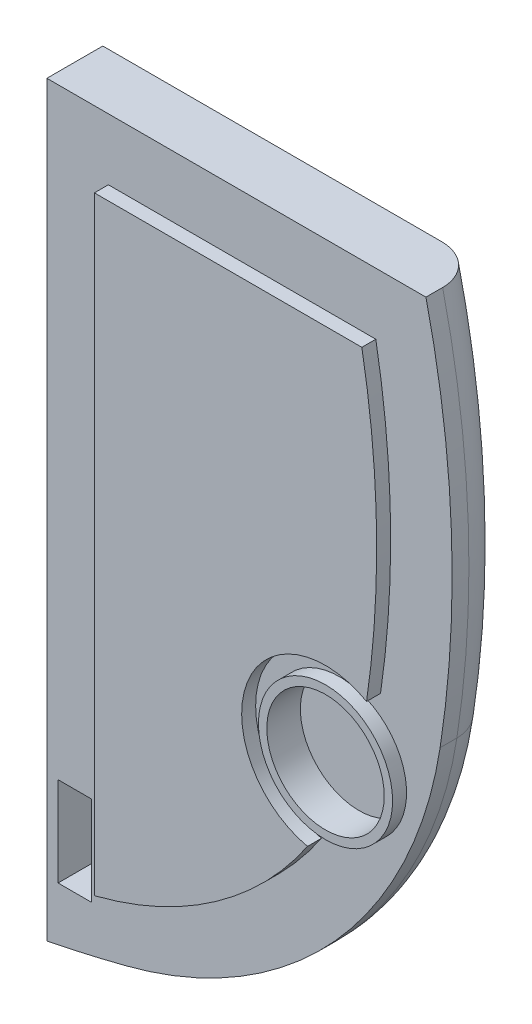
ISO-10303-21;
HEADER;
FILE_DESCRIPTION(('STEP AP214'),'2;1');
FILE_NAME('part.step','',(''),(''),'','','');
FILE_SCHEMA(('AUTOMOTIVE_DESIGN { 1 0 10303 214 1 1 1 1 }'));
ENDSEC;
DATA;
#1=APPLICATION_CONTEXT('core data for automotive mechanical design processes');
#2=APPLICATION_PROTOCOL_DEFINITION('international standard','automotive_design',2000,#1);
#3=PRODUCT_CONTEXT('',#1,'mechanical');
#4=PRODUCT('Part','Part','',(#3));
#5=PRODUCT_RELATED_PRODUCT_CATEGORY('part','',(#4));
#6=PRODUCT_DEFINITION_FORMATION('','',#4);
#7=PRODUCT_DEFINITION_CONTEXT('part definition',#1,'design');
#8=PRODUCT_DEFINITION('design','',#6,#7);
#9=PRODUCT_DEFINITION_SHAPE('','',#8);
#10=(LENGTH_UNIT() NAMED_UNIT(*) SI_UNIT(.MILLI.,.METRE.));
#11=(NAMED_UNIT(*) PLANE_ANGLE_UNIT() SI_UNIT($,.RADIAN.));
#12=(NAMED_UNIT(*) SI_UNIT($,.STERADIAN.) SOLID_ANGLE_UNIT());
#13=UNCERTAINTY_MEASURE_WITH_UNIT(LENGTH_MEASURE(1.E-05),#10,'distance_accuracy_value','');
#14=(GEOMETRIC_REPRESENTATION_CONTEXT(3) GLOBAL_UNCERTAINTY_ASSIGNED_CONTEXT((#13)) GLOBAL_UNIT_ASSIGNED_CONTEXT((#10,
#11,#12)) REPRESENTATION_CONTEXT('',''));
#15=CARTESIAN_POINT('',(0.,0.,0.));
#16=DIRECTION('',(0.,0.,1.));
#17=DIRECTION('',(1.,0.,0.));
#18=AXIS2_PLACEMENT_3D('',#15,#16,#17);
#19=CARTESIAN_POINT('',(-53.6029276968622,132.600606577342,10.));
#20=DIRECTION('',(0.,0.,-1.));
#21=DIRECTION('',(-1.,0.,0.));
#22=AXIS2_PLACEMENT_3D('',#19,#20,#21);
#23=PLANE('',#22);
#24=CARTESIAN_POINT('',(52.341123560557,-78.5270525814597,10.));
#25=DIRECTION('',(0.,0.,-1.));
#26=DIRECTION('',(-1.,0.,0.));
#27=AXIS2_PLACEMENT_3D('',#24,#25,#26);
#28=CIRCLE('',#27,12.);
#29=CARTESIAN_POINT('',(40.341123560557,-78.5270525814597,10.));
#30=VERTEX_POINT('',#29);
#31=EDGE_CURVE('E11',#30,#30,#28,.F.);
#32=ORIENTED_EDGE('',*,*,#31,.F.);
#33=EDGE_LOOP('',(#32));
#34=FACE_BOUND('',#33,.T.);
#35=DIRECTION('',(0.,1.,0.));
#36=VECTOR('',#35,1.);
#37=CARTESIAN_POINT('',(8.,-123.657325027192,10.));
#38=LINE('',#37,#36);
#39=CARTESIAN_POINT('',(8.,-123.657325027192,10.));
#40=VERTEX_POINT('',#39);
#41=CARTESIAN_POINT('',(8.,-107.657325027192,10.));
#42=VERTEX_POINT('',#41);
#43=EDGE_CURVE('E199',#40,#42,#38,.T.);
#44=ORIENTED_EDGE('',*,*,#43,.F.);
#45=DIRECTION('',(1.,0.,0.));
#46=VECTOR('',#45,1.);
#47=CARTESIAN_POINT('',(2.,-123.657325027192,10.));
#48=LINE('',#47,#46);
#49=CARTESIAN_POINT('',(2.,-123.657325027192,10.));
#50=VERTEX_POINT('',#49);
#51=EDGE_CURVE('E56',#50,#40,#48,.T.);
#52=ORIENTED_EDGE('',*,*,#51,.F.);
#53=DIRECTION('',(0.,-1.,0.));
#54=VECTOR('',#53,1.);
#55=CARTESIAN_POINT('',(2.,-107.657325027192,10.));
#56=LINE('',#55,#54);
#57=CARTESIAN_POINT('',(2.,-107.657325027192,10.));
#58=VERTEX_POINT('',#57);
#59=EDGE_CURVE('E183',#58,#50,#56,.T.);
#60=ORIENTED_EDGE('',*,*,#59,.F.);
#61=DIRECTION('',(-1.,0.,0.));
#62=VECTOR('',#61,1.);
#63=CARTESIAN_POINT('',(8.,-107.657325027192,10.));
#64=LINE('',#63,#62);
#65=EDGE_CURVE('E187',#42,#58,#64,.T.);
#66=ORIENTED_EDGE('',*,*,#65,.F.);
#67=EDGE_LOOP('',(#44,#52,#60,#66));
#68=FACE_BOUND('',#67,.T.);
#69=DIRECTION('',(0.,-1.,0.));
#70=VECTOR('',#69,1.);
#71=CARTESIAN_POINT('',(0.,0.,10.));
#72=LINE('',#71,#70);
#73=CARTESIAN_POINT('',(0.,0.,10.));
#74=VERTEX_POINT('',#73);
#75=CARTESIAN_POINT('',(0.,-133.657325027192,10.));
#76=VERTEX_POINT('',#75);
#77=EDGE_CURVE('E278',#74,#76,#72,.T.);
#78=ORIENTED_EDGE('',*,*,#77,.T.);
#79=CARTESIAN_POINT('',(-53.6029276968622,132.600606577342,10.));
#80=DIRECTION('',(0.,0.,1.));
#81=DIRECTION('',(-1.,0.,0.));
#82=AXIS2_PLACEMENT_3D('',#79,#80,#81);
#83=CIRCLE('',#82,271.6);
#84=CARTESIAN_POINT('',(14.2335462658166,-130.391356798558,10.));
#85=VERTEX_POINT('',#84);
#86=EDGE_CURVE('E282',#76,#85,#83,.T.);
#87=ORIENTED_EDGE('',*,*,#86,.T.);
#88=CARTESIAN_POINT('',(-4.74867767072094,-56.8000857508097,10.));
#89=DIRECTION('',(0.,0.,1.));
#90=DIRECTION('',(-1.,0.,0.));
#91=AXIS2_PLACEMENT_3D('',#88,#89,#90);
#92=CIRCLE('',#91,76.);
#93=CARTESIAN_POINT('',(70.341123560557,-68.5270525814597,10.));
#94=VERTEX_POINT('',#93);
#95=EDGE_CURVE('E286',#85,#94,#92,.T.);
#96=ORIENTED_EDGE('',*,*,#95,.T.);
#97=CARTESIAN_POINT('',(-107.2,-40.8,10.));
#98=DIRECTION('',(0.,0.,1.));
#99=DIRECTION('',(-1.,0.,0.));
#100=AXIS2_PLACEMENT_3D('',#97,#98,#99);
#101=CIRCLE('',#100,179.693182953611);
#102=CARTESIAN_POINT('',(67.8,0.,10.));
#103=VERTEX_POINT('',#102);
#104=EDGE_CURVE('E289',#94,#103,#101,.T.);
#105=ORIENTED_EDGE('',*,*,#104,.T.);
#106=DIRECTION('',(-1.,0.,0.));
#107=VECTOR('',#106,1.);
#108=CARTESIAN_POINT('',(0.,0.,10.));
#109=LINE('',#108,#107);
#110=EDGE_CURVE('E292',#103,#74,#109,.T.);
#111=ORIENTED_EDGE('',*,*,#110,.T.);
#112=EDGE_LOOP('',(#78,#87,#96,#105,#111));
#113=FACE_BOUND('',#112,.T.);
#114=CARTESIAN_POINT('',(-107.2,-40.8,10.));
#115=DIRECTION('',(0.,0.,1.));
#116=DIRECTION('',(1.,0.,0.));
#117=AXIS2_PLACEMENT_3D('',#114,#115,#116);
#118=CIRCLE('',#117,168.693182953611);
#119=CARTESIAN_POINT('',(59.6829910814193,-65.4466481035353,10.));
#120=VERTEX_POINT('',#119);
#121=CARTESIAN_POINT('',(58.8402058991152,-11.,10.));
#122=VERTEX_POINT('',#121);
#123=EDGE_CURVE('E208',#120,#122,#118,.T.);
#124=ORIENTED_EDGE('',*,*,#123,.F.);
#125=CARTESIAN_POINT('',(52.341123560557,-78.5270525814597,10.));
#126=DIRECTION('',(0.,0.,-1.));
#127=DIRECTION('',(1.,0.,0.));
#128=AXIS2_PLACEMENT_3D('',#125,#126,#127);
#129=CIRCLE('',#128,14.9999999999999);
#130=CARTESIAN_POINT('',(49.1190077555964,-93.1768979642418,10.));
#131=VERTEX_POINT('',#130);
#132=EDGE_CURVE('E219',#131,#120,#129,.T.);
#133=ORIENTED_EDGE('',*,*,#132,.F.);
#134=CARTESIAN_POINT('',(-4.74867767072094,-56.8000857508097,10.));
#135=DIRECTION('',(0.,0.,1.));
#136=DIRECTION('',(1.,0.,0.));
#137=AXIS2_PLACEMENT_3D('',#134,#135,#136);
#138=CIRCLE('',#137,65.);
#139=CARTESIAN_POINT('',(11.4861191171073,-119.739988620594,10.));
#140=VERTEX_POINT('',#139);
#141=EDGE_CURVE('E248',#140,#131,#138,.T.);
#142=ORIENTED_EDGE('',*,*,#141,.F.);
#143=CARTESIAN_POINT('',(-53.6029276968622,132.600606577342,10.));
#144=DIRECTION('',(0.,0.,1.));
#145=DIRECTION('',(1.,0.,0.));
#146=AXIS2_PLACEMENT_3D('',#143,#144,#145);
#147=CIRCLE('',#146,260.6);
#148=CARTESIAN_POINT('',(10.9999999999998,-119.86487964403,10.));
#149=VERTEX_POINT('',#148);
#150=EDGE_CURVE('E244',#149,#140,#147,.T.);
#151=ORIENTED_EDGE('',*,*,#150,.F.);
#152=DIRECTION('',(0.,-1.,0.));
#153=VECTOR('',#152,1.);
#154=CARTESIAN_POINT('',(11.,-11.,10.));
#155=LINE('',#154,#153);
#156=CARTESIAN_POINT('',(11.,-11.,10.));
#157=VERTEX_POINT('',#156);
#158=EDGE_CURVE('E240',#157,#149,#155,.T.);
#159=ORIENTED_EDGE('',*,*,#158,.F.);
#160=DIRECTION('',(-1.,0.,0.));
#161=VECTOR('',#160,1.);
#162=CARTESIAN_POINT('',(58.8402058991152,-11.,10.));
#163=LINE('',#162,#161);
#164=EDGE_CURVE('E64',#122,#157,#163,.T.);
#165=ORIENTED_EDGE('',*,*,#164,.F.);
#166=EDGE_LOOP('',(#124,#133,#142,#151,#159,#165));
#167=FACE_BOUND('',#166,.T.);
#168=ADVANCED_FACE('F39',(#34,#68,#113,#167),#23,.F.);
#169=CARTESIAN_POINT('',(0.,0.,10.));
#170=DIRECTION('',(1.,0.,0.));
#171=DIRECTION('',(0.,1.,0.));
#172=AXIS2_PLACEMENT_3D('',#169,#170,#171);
#173=PLANE('',#172);
#174=DIRECTION('',(0.,-1.,0.));
#175=VECTOR('',#174,1.);
#176=CARTESIAN_POINT('',(0.,0.,0.));
#177=LINE('',#176,#175);
#178=CARTESIAN_POINT('',(0.,0.,0.));
#179=VERTEX_POINT('',#178);
#180=CARTESIAN_POINT('',(0.,-126.513048296971,0.));
#181=VERTEX_POINT('',#180);
#182=EDGE_CURVE('E296',#179,#181,#177,.T.);
#183=ORIENTED_EDGE('',*,*,#182,.T.);
#184=CARTESIAN_POINT('',(0.,-126.513048296971,0.));
#185=CARTESIAN_POINT('',(0.,-126.71709941798,-1.89778988025318E-05));
#186=CARTESIAN_POINT('',(0.,-126.921149442157,0.00855526177181176));
#187=CARTESIAN_POINT('',(0.,-127.327814839988,0.0427592776785941));
#188=CARTESIAN_POINT('',(0.,-127.530430215608,0.0683890305444192));
#189=CARTESIAN_POINT('',(0.,-127.932768353681,0.136568756663049));
#190=CARTESIAN_POINT('',(0.,-128.13249148761,0.179116536655551));
#191=CARTESIAN_POINT('',(0.,-128.527646335021,0.280865143726202));
#192=CARTESIAN_POINT('',(0.,-128.723078141211,0.340065610670325));
#193=CARTESIAN_POINT('',(0.,-129.108356675586,0.474790642814504));
#194=CARTESIAN_POINT('',(0.,-129.298200211193,0.550324341163546));
#195=CARTESIAN_POINT('',(0.,-129.670866807138,0.717245087932252));
#196=CARTESIAN_POINT('',(0.,-129.853687393808,0.808637660853026));
#197=CARTESIAN_POINT('',(0.,-130.210789940611,1.00661447943289));
#198=CARTESIAN_POINT('',(0.,-130.385076194758,1.11319097760147));
#199=CARTESIAN_POINT('',(0.,-130.723891497751,1.34086283553365));
#200=CARTESIAN_POINT('',(0.,-130.888420735897,1.46195791347809));
#201=CARTESIAN_POINT('',(0.,-131.20486791767,1.71656668240142));
#202=CARTESIAN_POINT('',(0.,-131.356895534672,1.84994405648142));
#203=CARTESIAN_POINT('',(0.,-131.648931702705,2.12917095628143));
#204=CARTESIAN_POINT('',(0.,-131.788944460213,2.27501608097336));
#205=CARTESIAN_POINT('',(0.,-132.055962056546,2.57826107853855));
#206=CARTESIAN_POINT('',(0.,-132.18296214766,2.73566513301883));
#207=CARTESIAN_POINT('',(0.,-132.422878554623,3.06085972912421));
#208=CARTESIAN_POINT('',(0.,-132.535795341027,3.22864992344447));
#209=CARTESIAN_POINT('',(0.,-132.744594755959,3.57007474737394));
#210=CARTESIAN_POINT('',(0.,-132.8407640762,3.74353408617211));
#211=CARTESIAN_POINT('',(0.,-133.017911538306,4.09803834100657));
#212=CARTESIAN_POINT('',(0.,-133.098890186947,4.27908300374199));
#213=CARTESIAN_POINT('',(0.,-133.244954954352,4.64733328437091));
#214=CARTESIAN_POINT('',(0.,-133.31005219958,4.83453448406384));
#215=CARTESIAN_POINT('',(0.,-133.423878244228,5.21376899895905));
#216=CARTESIAN_POINT('',(0.,-133.472611888379,5.4058008658262));
#217=CARTESIAN_POINT('',(0.,-133.560935236628,5.82988719943436));
#218=CARTESIAN_POINT('',(0.,-133.597080454667,6.06267524368155));
#219=CARTESIAN_POINT('',(0.,-133.633223044847,6.41344496424587));
#220=CARTESIAN_POINT('',(0.,-133.642258025721,6.53056716314789));
#221=CARTESIAN_POINT('',(0.,-133.65430872672,6.76511837237056));
#222=CARTESIAN_POINT('',(0.,-133.65732457264,6.88254737622785));
#223=CARTESIAN_POINT('',(0.,-133.657325027192,7.));
#224=B_SPLINE_CURVE_WITH_KNOTS('',3,(#184,#185,#186,#187,#188,#189,#190,#191,#192,#193,#194,
#195,#196,#197,#198,#199,#200,#201,#202,#203,#204,#205,#206,#207,#208,#209,#210,#211,#212,#213,
#214,#215,#216,#217,#218,#219,#220,#221,#222,#223),.UNSPECIFIED.,.F.,.F.,(4,2,2,2,2,2,2,2,2,2,2,
2,2,2,2,2,2,2,2,4),(0.,0.611972068119969,1.223943297686,1.83583521689208,2.44771390422982,
3.05993562824449,3.67237105181598,4.28449509631683,4.89660726084242,5.50259742681086,
6.10837455889394,6.71437192942719,7.32034904679214,7.91463114807676,8.50889341996665,
9.10273815008891,9.69640690669095,10.4017498583619,10.7540292795827,11.1063013383514),.UNSPECIFIED.);
#225=CARTESIAN_POINT('',(0.,-133.657325027192,7.));
#226=VERTEX_POINT('',#225);
#227=EDGE_CURVE('E335',#181,#226,#224,.T.);
#228=ORIENTED_EDGE('',*,*,#227,.T.);
#229=DIRECTION('',(0.,0.,-1.));
#230=VECTOR('',#229,1.);
#231=CARTESIAN_POINT('',(0.,-133.657325027192,10.));
#232=LINE('',#231,#230);
#233=EDGE_CURVE('E318',#76,#226,#232,.T.);
#234=ORIENTED_EDGE('',*,*,#233,.F.);
#235=ORIENTED_EDGE('',*,*,#77,.F.);
#236=DIRECTION('',(0.,0.,-1.));
#237=VECTOR('',#236,1.);
#238=CARTESIAN_POINT('',(0.,0.,10.));
#239=LINE('',#238,#237);
#240=EDGE_CURVE('E295',#74,#179,#239,.T.);
#241=ORIENTED_EDGE('',*,*,#240,.T.);
#242=EDGE_LOOP('',(#183,#228,#234,#235,#241));
#243=FACE_BOUND('',#242,.T.);
#244=ADVANCED_FACE('F348',(#243),#173,.F.);
#245=CARTESIAN_POINT('',(-53.6029276968622,132.600606577342,10.));
#246=DIRECTION('',(0.,0.,-1.));
#247=DIRECTION('',(-1.,0.,0.));
#248=AXIS2_PLACEMENT_3D('',#245,#246,#247);
#249=CYLINDRICAL_SURFACE('',#248,271.6);
#250=ORIENTED_EDGE('',*,*,#233,.T.);
#251=CARTESIAN_POINT('',(-53.6029276968622,132.600606577342,7.));
#252=DIRECTION('',(0.,0.,-1.));
#253=DIRECTION('',(-1.,0.,0.));
#254=AXIS2_PLACEMENT_3D('',#251,#252,#253);
#255=CIRCLE('',#254,271.6);
#256=CARTESIAN_POINT('',(14.2335462658166,-130.391356798558,7.));
#257=VERTEX_POINT('',#256);
#258=EDGE_CURVE('E322',#226,#257,#255,.F.);
#259=ORIENTED_EDGE('',*,*,#258,.T.);
#260=DIRECTION('',(0.,0.,-1.));
#261=VECTOR('',#260,1.);
#262=CARTESIAN_POINT('',(14.2335462658166,-130.391356798558,10.));
#263=LINE('',#262,#261);
#264=EDGE_CURVE('E314',#85,#257,#263,.T.);
#265=ORIENTED_EDGE('',*,*,#264,.F.);
#266=ORIENTED_EDGE('',*,*,#86,.F.);
#267=EDGE_LOOP('',(#250,#259,#265,#266));
#268=FACE_BOUND('',#267,.T.);
#269=ADVANCED_FACE('F352',(#268),#249,.T.);
#270=CARTESIAN_POINT('',(-4.74867767072094,-56.8000857508097,10.));
#271=DIRECTION('',(0.,0.,-1.));
#272=DIRECTION('',(-1.,0.,0.));
#273=AXIS2_PLACEMENT_3D('',#270,#271,#272);
#274=CYLINDRICAL_SURFACE('',#273,76.);
#275=ORIENTED_EDGE('',*,*,#264,.T.);
#276=CARTESIAN_POINT('',(-4.74867767072094,-56.8000857508097,7.));
#277=DIRECTION('',(0.,0.,-1.));
#278=DIRECTION('',(-1.,0.,0.));
#279=AXIS2_PLACEMENT_3D('',#276,#277,#278);
#280=CIRCLE('',#279,76.);
#281=CARTESIAN_POINT('',(70.341123560557,-68.5270525814597,7.));
#282=VERTEX_POINT('',#281);
#283=EDGE_CURVE('E344',#257,#282,#280,.F.);
#284=ORIENTED_EDGE('',*,*,#283,.T.);
#285=DIRECTION('',(0.,0.,-1.));
#286=VECTOR('',#285,1.);
#287=CARTESIAN_POINT('',(70.341123560557,-68.5270525814597,10.));
#288=LINE('',#287,#286);
#289=EDGE_CURVE('E310',#94,#282,#288,.T.);
#290=ORIENTED_EDGE('',*,*,#289,.F.);
#291=ORIENTED_EDGE('',*,*,#95,.F.);
#292=EDGE_LOOP('',(#275,#284,#290,#291));
#293=FACE_BOUND('',#292,.T.);
#294=ADVANCED_FACE('F356',(#293),#274,.T.);
#295=CARTESIAN_POINT('',(-107.2,-40.8,10.));
#296=DIRECTION('',(0.,0.,-1.));
#297=DIRECTION('',(-1.,0.,0.));
#298=AXIS2_PLACEMENT_3D('',#295,#296,#297);
#299=CYLINDRICAL_SURFACE('',#298,179.693182953611);
#300=ORIENTED_EDGE('',*,*,#289,.T.);
#301=CARTESIAN_POINT('',(-107.2,-40.8,7.));
#302=DIRECTION('',(0.,0.,-1.));
#303=DIRECTION('',(-1.,0.,0.));
#304=AXIS2_PLACEMENT_3D('',#301,#302,#303);
#305=CIRCLE('',#304,179.693182953611);
#306=CARTESIAN_POINT('',(67.8,0.,7.));
#307=VERTEX_POINT('',#306);
#308=EDGE_CURVE('E379',#282,#307,#305,.F.);
#309=ORIENTED_EDGE('',*,*,#308,.T.);
#310=DIRECTION('',(0.,0.,-1.));
#311=VECTOR('',#310,1.);
#312=CARTESIAN_POINT('',(67.8,0.,10.));
#313=LINE('',#312,#311);
#314=EDGE_CURVE('E306',#103,#307,#313,.T.);
#315=ORIENTED_EDGE('',*,*,#314,.F.);
#316=ORIENTED_EDGE('',*,*,#104,.F.);
#317=EDGE_LOOP('',(#300,#309,#315,#316));
#318=FACE_BOUND('',#317,.T.);
#319=ADVANCED_FACE('F360',(#318),#299,.T.);
#320=CARTESIAN_POINT('',(0.,0.,10.));
#321=DIRECTION('',(0.,-1.,0.));
#322=DIRECTION('',(0.,0.,-1.));
#323=AXIS2_PLACEMENT_3D('',#320,#321,#322);
#324=PLANE('',#323);
#325=ORIENTED_EDGE('',*,*,#314,.T.);
#326=CARTESIAN_POINT('',(67.8,0.,7.));
#327=CARTESIAN_POINT('',(67.8000242314605,0.,6.80688821042946));
#328=CARTESIAN_POINT('',(67.7917955621142,0.,6.61378127071016));
#329=CARTESIAN_POINT('',(67.759008531013,0.,6.22897706440818));
#330=CARTESIAN_POINT('',(67.7344517789801,0.,6.03727966074823));
#331=CARTESIAN_POINT('',(67.6692323501126,0.,5.65693419256613));
#332=CARTESIAN_POINT('',(67.6285932787217,0.,5.46828207871531));
#333=CARTESIAN_POINT('',(67.5315486168658,0.,5.09507974514581));
#334=CARTESIAN_POINT('',(67.4751430667482,0.,4.91052951493146));
#335=CARTESIAN_POINT('',(67.3470171388395,0.,4.54681847840191));
#336=CARTESIAN_POINT('',(67.2752962021097,0.,4.36765786905452));
#337=CARTESIAN_POINT('',(67.1170839156484,0.,4.01590438231978));
#338=CARTESIAN_POINT('',(67.0305871212917,0.,3.84331395469057));
#339=CARTESIAN_POINT('',(66.8435540328116,0.,3.50600103951331));
#340=CARTESIAN_POINT('',(66.7430228793185,0.,3.34127570058618));
#341=CARTESIAN_POINT('',(66.5286305235732,0.,3.0206556576246));
#342=CARTESIAN_POINT('',(66.414764357282,0.,2.86476427433233));
#343=CARTESIAN_POINT('',(66.1733113781952,0.,2.5612786572959));
#344=CARTESIAN_POINT('',(66.0455915843727,0.,2.41379023449239));
#345=CARTESIAN_POINT('',(65.7783541329569,0.,2.1298224267464));
#346=CARTESIAN_POINT('',(65.6388321478177,0.,1.99334711617001));
#347=CARTESIAN_POINT('',(65.3490781894079,0.,1.73233736283605));
#348=CARTESIAN_POINT('',(65.1988479714313,0.,1.60780097086263));
#349=CARTESIAN_POINT('',(64.8886778732346,0.,1.37135425579177));
#350=CARTESIAN_POINT('',(64.7287344525287,0.,1.25944857962402));
#351=CARTESIAN_POINT('',(64.396232078268,0.,1.04636279598464));
#352=CARTESIAN_POINT('',(64.2234587534013,0.,0.945517084412295));
#353=CARTESIAN_POINT('',(63.870176903432,0.,0.758430544642893));
#354=CARTESIAN_POINT('',(63.6896680946321,0.,0.672190252672042));
#355=CARTESIAN_POINT('',(63.3222044223663,0.,0.514830064927717));
#356=CARTESIAN_POINT('',(63.1352506623432,0.,0.443707595621188));
#357=CARTESIAN_POINT('',(62.7562188002329,0.,0.316975926496635));
#358=CARTESIAN_POINT('',(62.5641412379694,0.,0.261365099449943));
#359=CARTESIAN_POINT('',(62.0813229181844,0.,0.14266560101704));
#360=CARTESIAN_POINT('',(61.7881432327001,0.,0.0891535147060662));
#361=CARTESIAN_POINT('',(61.3455831037314,0.,0.0356621051099258));
#362=CARTESIAN_POINT('',(61.1976784470924,0.,0.0222944262628942));
#363=CARTESIAN_POINT('',(60.9013100072291,0.,0.0044642501813533));
#364=CARTESIAN_POINT('',(60.7528461404903,0.,3.14057454794549E-06));
#365=CARTESIAN_POINT('',(60.6043367694931,0.,0.));
#366=B_SPLINE_CURVE_WITH_KNOTS('',3,(#326,#327,#328,#329,#330,#331,#332,#333,#334,#335,#336,
#337,#338,#339,#340,#341,#342,#343,#344,#345,#346,#347,#348,#349,#350,#351,#352,#353,#354,#355,
#356,#357,#358,#359,#360,#361,#362,#363,#364,#365),.UNSPECIFIED.,.F.,.F.,(4,2,2,2,2,2,2,2,2,2,2,
2,2,2,2,2,2,2,2,4),(0.,0.579152951458244,1.1582488149502,1.73649782218706,2.31474534966315,
2.89301398402791,3.47149616094792,4.04976699951832,4.62825379127707,5.2128897480648,
5.79774101215073,6.38249662688782,6.96746668088723,7.56692872660279,8.16641277631502,
8.76579469294819,9.36511370853267,10.2566747601426,10.7019754180262,11.1473454475509),.UNSPECIFIED.);
#367=CARTESIAN_POINT('',(60.6043367694931,0.,0.));
#368=VERTEX_POINT('',#367);
#369=EDGE_CURVE('E49',#307,#368,#366,.T.);
#370=ORIENTED_EDGE('',*,*,#369,.T.);
#371=DIRECTION('',(-1.,0.,0.));
#372=VECTOR('',#371,1.);
#373=CARTESIAN_POINT('',(0.,0.,0.));
#374=LINE('',#373,#372);
#375=EDGE_CURVE('E283',#368,#179,#374,.T.);
#376=ORIENTED_EDGE('',*,*,#375,.T.);
#377=ORIENTED_EDGE('',*,*,#240,.F.);
#378=ORIENTED_EDGE('',*,*,#110,.F.);
#379=EDGE_LOOP('',(#325,#370,#376,#377,#378));
#380=FACE_BOUND('',#379,.T.);
#381=ADVANCED_FACE('F364',(#380),#324,.F.);
#382=CARTESIAN_POINT('',(-53.6029276968622,132.600606577342,0.));
#383=DIRECTION('',(0.,0.,-1.));
#384=DIRECTION('',(-1.,0.,0.));
#385=AXIS2_PLACEMENT_3D('',#382,#383,#384);
#386=PLANE('',#385);
#387=CARTESIAN_POINT('',(-4.74867767072094,-56.8000857508097,0.));
#388=DIRECTION('',(0.,0.,-1.));
#389=DIRECTION('',(-1.,0.,0.));
#390=AXIS2_PLACEMENT_3D('',#387,#388,#389);
#391=CIRCLE('',#390,69.);
#392=CARTESIAN_POINT('',(63.4249576576762,-67.4469372154788,0.));
#393=VERTEX_POINT('',#392);
#394=CARTESIAN_POINT('',(12.4851835348197,-123.613213412581,0.));
#395=VERTEX_POINT('',#394);
#396=EDGE_CURVE('E329',#393,#395,#391,.T.);
#397=ORIENTED_EDGE('',*,*,#396,.T.);
#398=CARTESIAN_POINT('',(-53.6029276968622,132.600606577342,0.));
#399=DIRECTION('',(0.,0.,-1.));
#400=DIRECTION('',(-1.,0.,0.));
#401=AXIS2_PLACEMENT_3D('',#398,#399,#400);
#402=CIRCLE('',#401,264.6);
#403=EDGE_CURVE('E332',#395,#181,#402,.T.);
#404=ORIENTED_EDGE('',*,*,#403,.T.);
#405=ORIENTED_EDGE('',*,*,#182,.F.);
#406=ORIENTED_EDGE('',*,*,#375,.F.);
#407=CARTESIAN_POINT('',(-107.2,-40.8,0.));
#408=DIRECTION('',(0.,0.,-1.));
#409=DIRECTION('',(-1.,0.,0.));
#410=AXIS2_PLACEMENT_3D('',#407,#408,#409);
#411=CIRCLE('',#410,172.693182953611);
#412=EDGE_CURVE('E326',#368,#393,#411,.T.);
#413=ORIENTED_EDGE('',*,*,#412,.T.);
#414=EDGE_LOOP('',(#397,#404,#405,#406,#413));
#415=FACE_BOUND('',#414,.T.);
#416=ADVANCED_FACE('F369',(#415),#386,.T.);
#417=CARTESIAN_POINT('',(-107.2,-40.8,7.));
#418=DIRECTION('',(0.,0.,-1.));
#419=DIRECTION('',(-1.,0.,0.));
#420=AXIS2_PLACEMENT_3D('',#417,#418,#419);
#421=TOROIDAL_SURFACE('',#420,172.693182953611,7.);
#422=ORIENTED_EDGE('',*,*,#369,.F.);
#423=ORIENTED_EDGE('',*,*,#308,.F.);
#424=CARTESIAN_POINT('',(63.4249576576762,-67.4469372154788,7.));
#425=DIRECTION('',(-0.154302195140132,-0.988023700411552,0.));
#426=DIRECTION('',(0.988023700411552,-0.154302195140132,0.));
#427=AXIS2_PLACEMENT_3D('',#424,#425,#426);
#428=CIRCLE('',#427,7.);
#429=EDGE_CURVE('E300',#393,#282,#428,.T.);
#430=ORIENTED_EDGE('',*,*,#429,.F.);
#431=ORIENTED_EDGE('',*,*,#412,.F.);
#432=EDGE_LOOP('',(#422,#423,#430,#431));
#433=FACE_BOUND('',#432,.T.);
#434=ADVANCED_FACE('F41',(#433),#421,.T.);
#435=CARTESIAN_POINT('',(-4.74867767072094,-56.8000857508097,7.));
#436=DIRECTION('',(0.,0.,-1.));
#437=DIRECTION('',(-1.,0.,0.));
#438=AXIS2_PLACEMENT_3D('',#435,#436,#437);
#439=TOROIDAL_SURFACE('',#438,69.,7.);
#440=ORIENTED_EDGE('',*,*,#429,.T.);
#441=ORIENTED_EDGE('',*,*,#283,.F.);
#442=CARTESIAN_POINT('',(12.4851835348197,-123.613213412581,7.));
#443=DIRECTION('',(-0.968306197996687,-0.249766104428125,0.));
#444=DIRECTION('',(0.249766104428125,-0.968306197996687,0.));
#445=AXIS2_PLACEMENT_3D('',#442,#443,#444);
#446=CIRCLE('',#445,7.);
#447=EDGE_CURVE('E277',#395,#257,#446,.T.);
#448=ORIENTED_EDGE('',*,*,#447,.F.);
#449=ORIENTED_EDGE('',*,*,#396,.F.);
#450=EDGE_LOOP('',(#440,#441,#448,#449));
#451=FACE_BOUND('',#450,.T.);
#452=ADVANCED_FACE('F387',(#451),#439,.T.);
#453=CARTESIAN_POINT('',(-53.6029276968622,132.600606577342,7.));
#454=DIRECTION('',(0.,0.,-1.));
#455=DIRECTION('',(-1.,0.,0.));
#456=AXIS2_PLACEMENT_3D('',#453,#454,#455);
#457=TOROIDAL_SURFACE('',#456,264.6,7.);
#458=ORIENTED_EDGE('',*,*,#227,.F.);
#459=ORIENTED_EDGE('',*,*,#403,.F.);
#460=ORIENTED_EDGE('',*,*,#447,.T.);
#461=ORIENTED_EDGE('',*,*,#258,.F.);
#462=EDGE_LOOP('',(#458,#459,#460,#461));
#463=FACE_BOUND('',#462,.T.);
#464=ADVANCED_FACE('F346',(#463),#457,.T.);
#465=CARTESIAN_POINT('',(-107.2,-40.8,12.5));
#466=DIRECTION('',(0.,0.,-1.));
#467=DIRECTION('',(-1.,0.,0.));
#468=AXIS2_PLACEMENT_3D('',#465,#466,#467);
#469=CYLINDRICAL_SURFACE('',#468,168.693182953611);
#470=ORIENTED_EDGE('',*,*,#123,.T.);
#471=DIRECTION('',(0.,0.,-1.));
#472=VECTOR('',#471,1.);
#473=CARTESIAN_POINT('',(58.8402058991152,-11.,12.5));
#474=LINE('',#473,#472);
#475=CARTESIAN_POINT('',(58.8402058991152,-11.,12.5));
#476=VERTEX_POINT('',#475);
#477=EDGE_CURVE('E274',#476,#122,#474,.T.);
#478=ORIENTED_EDGE('',*,*,#477,.F.);
#479=CARTESIAN_POINT('',(-107.2,-40.8,12.5));
#480=DIRECTION('',(0.,0.,1.));
#481=DIRECTION('',(1.,0.,0.));
#482=AXIS2_PLACEMENT_3D('',#479,#480,#481);
#483=CIRCLE('',#482,168.693182953611);
#484=CARTESIAN_POINT('',(59.6829910814193,-65.4466481035353,12.5));
#485=VERTEX_POINT('',#484);
#486=EDGE_CURVE('E214',#485,#476,#483,.T.);
#487=ORIENTED_EDGE('',*,*,#486,.F.);
#488=DIRECTION('',(0.,0.,-1.));
#489=VECTOR('',#488,1.);
#490=CARTESIAN_POINT('',(59.6829910814193,-65.4466481035353,12.5));
#491=LINE('',#490,#489);
#492=EDGE_CURVE('E234',#485,#120,#491,.T.);
#493=ORIENTED_EDGE('',*,*,#492,.T.);
#494=EDGE_LOOP('',(#470,#478,#487,#493));
#495=FACE_BOUND('',#494,.T.);
#496=ADVANCED_FACE('F425',(#495),#469,.T.);
#497=CARTESIAN_POINT('',(58.8402058991152,-11.,12.5));
#498=DIRECTION('',(0.,-1.,0.));
#499=DIRECTION('',(0.,0.,-1.));
#500=AXIS2_PLACEMENT_3D('',#497,#498,#499);
#501=PLANE('',#500);
#502=ORIENTED_EDGE('',*,*,#164,.T.);
#503=DIRECTION('',(0.,0.,-1.));
#504=VECTOR('',#503,1.);
#505=CARTESIAN_POINT('',(11.,-11.,12.5));
#506=LINE('',#505,#504);
#507=CARTESIAN_POINT('',(11.,-11.,12.5));
#508=VERTEX_POINT('',#507);
#509=EDGE_CURVE('E270',#508,#157,#506,.T.);
#510=ORIENTED_EDGE('',*,*,#509,.F.);
#511=DIRECTION('',(-1.,0.,0.));
#512=VECTOR('',#511,1.);
#513=CARTESIAN_POINT('',(58.8402058991152,-11.,12.5));
#514=LINE('',#513,#512);
#515=EDGE_CURVE('E218',#476,#508,#514,.T.);
#516=ORIENTED_EDGE('',*,*,#515,.F.);
#517=ORIENTED_EDGE('',*,*,#477,.T.);
#518=EDGE_LOOP('',(#502,#510,#516,#517));
#519=FACE_BOUND('',#518,.T.);
#520=ADVANCED_FACE('F428',(#519),#501,.F.);
#521=CARTESIAN_POINT('',(11.,-11.,12.5));
#522=DIRECTION('',(1.,0.,0.));
#523=DIRECTION('',(0.,1.,0.));
#524=AXIS2_PLACEMENT_3D('',#521,#522,#523);
#525=PLANE('',#524);
#526=ORIENTED_EDGE('',*,*,#158,.T.);
#527=DIRECTION('',(0.,0.,-1.));
#528=VECTOR('',#527,1.);
#529=CARTESIAN_POINT('',(10.9999999999999,-119.86487964403,12.5));
#530=LINE('',#529,#528);
#531=CARTESIAN_POINT('',(10.9999999999999,-119.86487964403,12.5));
#532=VERTEX_POINT('',#531);
#533=EDGE_CURVE('E266',#532,#149,#530,.T.);
#534=ORIENTED_EDGE('',*,*,#533,.F.);
#535=DIRECTION('',(0.,-1.,0.));
#536=VECTOR('',#535,1.);
#537=CARTESIAN_POINT('',(11.,-11.,12.5));
#538=LINE('',#537,#536);
#539=EDGE_CURVE('E222',#508,#532,#538,.T.);
#540=ORIENTED_EDGE('',*,*,#539,.F.);
#541=ORIENTED_EDGE('',*,*,#509,.T.);
#542=EDGE_LOOP('',(#526,#534,#540,#541));
#543=FACE_BOUND('',#542,.T.);
#544=ADVANCED_FACE('F432',(#543),#525,.F.);
#545=CARTESIAN_POINT('',(-53.6029276968622,132.600606577342,12.5));
#546=DIRECTION('',(0.,0.,-1.));
#547=DIRECTION('',(-1.,0.,0.));
#548=AXIS2_PLACEMENT_3D('',#545,#546,#547);
#549=CYLINDRICAL_SURFACE('',#548,260.6);
#550=ORIENTED_EDGE('',*,*,#150,.T.);
#551=DIRECTION('',(0.,0.,-1.));
#552=VECTOR('',#551,1.);
#553=CARTESIAN_POINT('',(11.4861191171073,-119.739988620594,12.5));
#554=LINE('',#553,#552);
#555=CARTESIAN_POINT('',(11.4861191171073,-119.739988620594,12.5));
#556=VERTEX_POINT('',#555);
#557=EDGE_CURVE('E262',#556,#140,#554,.T.);
#558=ORIENTED_EDGE('',*,*,#557,.F.);
#559=CARTESIAN_POINT('',(-53.6029276968622,132.600606577342,12.5));
#560=DIRECTION('',(0.,0.,1.));
#561=DIRECTION('',(1.,0.,0.));
#562=AXIS2_PLACEMENT_3D('',#559,#560,#561);
#563=CIRCLE('',#562,260.6);
#564=EDGE_CURVE('E225',#532,#556,#563,.T.);
#565=ORIENTED_EDGE('',*,*,#564,.F.);
#566=ORIENTED_EDGE('',*,*,#533,.T.);
#567=EDGE_LOOP('',(#550,#558,#565,#566));
#568=FACE_BOUND('',#567,.T.);
#569=ADVANCED_FACE('F436',(#568),#549,.T.);
#570=CARTESIAN_POINT('',(-4.74867767072094,-56.8000857508097,12.5));
#571=DIRECTION('',(0.,0.,-1.));
#572=DIRECTION('',(-1.,0.,0.));
#573=AXIS2_PLACEMENT_3D('',#570,#571,#572);
#574=CYLINDRICAL_SURFACE('',#573,65.);
#575=ORIENTED_EDGE('',*,*,#141,.T.);
#576=DIRECTION('',(0.,0.,-1.));
#577=VECTOR('',#576,1.);
#578=CARTESIAN_POINT('',(49.1190077555964,-93.1768979642418,12.5));
#579=LINE('',#578,#577);
#580=CARTESIAN_POINT('',(49.1190077555964,-93.1768979642418,12.5));
#581=VERTEX_POINT('',#580);
#582=EDGE_CURVE('E258',#581,#131,#579,.T.);
#583=ORIENTED_EDGE('',*,*,#582,.F.);
#584=CARTESIAN_POINT('',(-4.74867767072094,-56.8000857508097,12.5));
#585=DIRECTION('',(0.,0.,1.));
#586=DIRECTION('',(1.,0.,0.));
#587=AXIS2_PLACEMENT_3D('',#584,#585,#586);
#588=CIRCLE('',#587,65.);
#589=EDGE_CURVE('E228',#556,#581,#588,.T.);
#590=ORIENTED_EDGE('',*,*,#589,.F.);
#591=ORIENTED_EDGE('',*,*,#557,.T.);
#592=EDGE_LOOP('',(#575,#583,#590,#591));
#593=FACE_BOUND('',#592,.T.);
#594=ADVANCED_FACE('F440',(#593),#574,.T.);
#595=CARTESIAN_POINT('',(52.341123560557,-78.5270525814597,12.5));
#596=DIRECTION('',(0.,0.,-1.));
#597=DIRECTION('',(-1.,0.,0.));
#598=AXIS2_PLACEMENT_3D('',#595,#596,#597);
#599=CYLINDRICAL_SURFACE('',#598,14.9999999999999);
#600=ORIENTED_EDGE('',*,*,#132,.T.);
#601=ORIENTED_EDGE('',*,*,#492,.F.);
#602=CARTESIAN_POINT('',(52.341123560557,-78.5270525814597,12.5));
#603=DIRECTION('',(0.,0.,-1.));
#604=DIRECTION('',(1.,0.,0.));
#605=AXIS2_PLACEMENT_3D('',#602,#603,#604);
#606=CIRCLE('',#605,14.9999999999999);
#607=EDGE_CURVE('E231',#581,#485,#606,.T.);
#608=ORIENTED_EDGE('',*,*,#607,.F.);
#609=ORIENTED_EDGE('',*,*,#582,.T.);
#610=EDGE_LOOP('',(#600,#601,#608,#609));
#611=FACE_BOUND('',#610,.T.);
#612=ADVANCED_FACE('F444',(#611),#599,.F.);
#613=CARTESIAN_POINT('',(-107.2,-40.8,12.5));
#614=DIRECTION('',(0.,0.,1.));
#615=DIRECTION('',(1.,0.,0.));
#616=AXIS2_PLACEMENT_3D('',#613,#614,#615);
#617=PLANE('',#616);
#618=ORIENTED_EDGE('',*,*,#486,.T.);
#619=ORIENTED_EDGE('',*,*,#515,.T.);
#620=ORIENTED_EDGE('',*,*,#539,.T.);
#621=ORIENTED_EDGE('',*,*,#564,.T.);
#622=ORIENTED_EDGE('',*,*,#589,.T.);
#623=ORIENTED_EDGE('',*,*,#607,.T.);
#624=EDGE_LOOP('',(#618,#619,#620,#621,#622,#623));
#625=FACE_BOUND('',#624,.T.);
#626=ADVANCED_FACE('F448',(#625),#617,.T.);
#627=CARTESIAN_POINT('',(2.,-123.657325027192,4.));
#628=DIRECTION('',(0.,-1.,0.));
#629=DIRECTION('',(0.,0.,-1.));
#630=AXIS2_PLACEMENT_3D('',#627,#628,#629);
#631=PLANE('',#630);
#632=ORIENTED_EDGE('',*,*,#51,.T.);
#633=DIRECTION('',(0.,0.,1.));
#634=VECTOR('',#633,1.);
#635=CARTESIAN_POINT('',(8.,-123.657325027192,4.));
#636=LINE('',#635,#634);
#637=CARTESIAN_POINT('',(8.,-123.657325027192,4.));
#638=VERTEX_POINT('',#637);
#639=EDGE_CURVE('E158',#638,#40,#636,.T.);
#640=ORIENTED_EDGE('',*,*,#639,.F.);
#641=DIRECTION('',(1.,0.,0.));
#642=VECTOR('',#641,1.);
#643=CARTESIAN_POINT('',(2.,-123.657325027192,4.));
#644=LINE('',#643,#642);
#645=CARTESIAN_POINT('',(2.,-123.657325027192,4.));
#646=VERTEX_POINT('',#645);
#647=EDGE_CURVE('E162',#646,#638,#644,.T.);
#648=ORIENTED_EDGE('',*,*,#647,.F.);
#649=DIRECTION('',(0.,0.,1.));
#650=VECTOR('',#649,1.);
#651=CARTESIAN_POINT('',(2.,-123.657325027192,4.));
#652=LINE('',#651,#650);
#653=EDGE_CURVE('E205',#646,#50,#652,.T.);
#654=ORIENTED_EDGE('',*,*,#653,.T.);
#655=EDGE_LOOP('',(#632,#640,#648,#654));
#656=FACE_BOUND('',#655,.T.);
#657=ADVANCED_FACE('F160',(#656),#631,.F.);
#658=CARTESIAN_POINT('',(2.,-107.657325027192,4.));
#659=DIRECTION('',(-1.,0.,0.));
#660=DIRECTION('',(0.,0.,1.));
#661=AXIS2_PLACEMENT_3D('',#658,#659,#660);
#662=PLANE('',#661);
#663=ORIENTED_EDGE('',*,*,#59,.T.);
#664=ORIENTED_EDGE('',*,*,#653,.F.);
#665=DIRECTION('',(0.,-1.,0.));
#666=VECTOR('',#665,1.);
#667=CARTESIAN_POINT('',(2.,-107.657325027192,4.));
#668=LINE('',#667,#666);
#669=CARTESIAN_POINT('',(2.,-107.657325027192,4.));
#670=VERTEX_POINT('',#669);
#671=EDGE_CURVE('E169',#670,#646,#668,.T.);
#672=ORIENTED_EDGE('',*,*,#671,.F.);
#673=DIRECTION('',(0.,0.,1.));
#674=VECTOR('',#673,1.);
#675=CARTESIAN_POINT('',(2.,-107.657325027192,4.));
#676=LINE('',#675,#674);
#677=EDGE_CURVE('E209',#670,#58,#676,.T.);
#678=ORIENTED_EDGE('',*,*,#677,.T.);
#679=EDGE_LOOP('',(#663,#664,#672,#678));
#680=FACE_BOUND('',#679,.T.);
#681=ADVANCED_FACE('F455',(#680),#662,.F.);
#682=CARTESIAN_POINT('',(8.,-107.657325027192,4.));
#683=DIRECTION('',(0.,1.,0.));
#684=DIRECTION('',(0.,0.,1.));
#685=AXIS2_PLACEMENT_3D('',#682,#683,#684);
#686=PLANE('',#685);
#687=ORIENTED_EDGE('',*,*,#65,.T.);
#688=ORIENTED_EDGE('',*,*,#677,.F.);
#689=DIRECTION('',(-1.,0.,0.));
#690=VECTOR('',#689,1.);
#691=CARTESIAN_POINT('',(8.,-107.657325027192,4.));
#692=LINE('',#691,#690);
#693=CARTESIAN_POINT('',(8.,-107.657325027192,4.));
#694=VERTEX_POINT('',#693);
#695=EDGE_CURVE('E178',#694,#670,#692,.T.);
#696=ORIENTED_EDGE('',*,*,#695,.F.);
#697=DIRECTION('',(0.,0.,1.));
#698=VECTOR('',#697,1.);
#699=CARTESIAN_POINT('',(8.,-107.657325027192,4.));
#700=LINE('',#699,#698);
#701=EDGE_CURVE('E168',#694,#42,#700,.T.);
#702=ORIENTED_EDGE('',*,*,#701,.T.);
#703=EDGE_LOOP('',(#687,#688,#696,#702));
#704=FACE_BOUND('',#703,.T.);
#705=ADVANCED_FACE('F458',(#704),#686,.F.);
#706=CARTESIAN_POINT('',(8.,-123.657325027192,4.));
#707=DIRECTION('',(1.,0.,0.));
#708=DIRECTION('',(0.,0.,-1.));
#709=AXIS2_PLACEMENT_3D('',#706,#707,#708);
#710=PLANE('',#709);
#711=ORIENTED_EDGE('',*,*,#43,.T.);
#712=ORIENTED_EDGE('',*,*,#701,.F.);
#713=DIRECTION('',(0.,1.,0.));
#714=VECTOR('',#713,1.);
#715=CARTESIAN_POINT('',(8.,-123.657325027192,4.));
#716=LINE('',#715,#714);
#717=EDGE_CURVE('E172',#638,#694,#716,.T.);
#718=ORIENTED_EDGE('',*,*,#717,.F.);
#719=ORIENTED_EDGE('',*,*,#639,.T.);
#720=EDGE_LOOP('',(#711,#712,#718,#719));
#721=FACE_BOUND('',#720,.T.);
#722=ADVANCED_FACE('F173',(#721),#710,.F.);
#723=CARTESIAN_POINT('',(0.,0.,4.));
#724=DIRECTION('',(0.,0.,1.));
#725=DIRECTION('',(1.,0.,0.));
#726=AXIS2_PLACEMENT_3D('',#723,#724,#725);
#727=PLANE('',#726);
#728=ORIENTED_EDGE('',*,*,#647,.T.);
#729=ORIENTED_EDGE('',*,*,#717,.T.);
#730=ORIENTED_EDGE('',*,*,#695,.T.);
#731=ORIENTED_EDGE('',*,*,#671,.T.);
#732=EDGE_LOOP('',(#728,#729,#730,#731));
#733=FACE_BOUND('',#732,.T.);
#734=ADVANCED_FACE('F180',(#733),#727,.T.);
#735=CARTESIAN_POINT('',(52.341123560557,-78.5270525814597,12.5));
#736=DIRECTION('',(0.,0.,-1.));
#737=DIRECTION('',(-1.,0.,0.));
#738=AXIS2_PLACEMENT_3D('',#735,#736,#737);
#739=CYLINDRICAL_SURFACE('',#738,12.);
#740=CARTESIAN_POINT('',(52.341123560557,-78.5270525814597,12.5));
#741=DIRECTION('',(0.,0.,1.));
#742=DIRECTION('',(1.,0.,0.));
#743=AXIS2_PLACEMENT_3D('',#740,#741,#742);
#744=CIRCLE('',#743,12.);
#745=CARTESIAN_POINT('',(64.341123560557,-78.5270525814597,12.5));
#746=VERTEX_POINT('',#745);
#747=EDGE_CURVE('E190',#746,#746,#744,.T.);
#748=ORIENTED_EDGE('',*,*,#747,.F.);
#749=EDGE_LOOP('',(#748));
#750=FACE_BOUND('',#749,.T.);
#751=ORIENTED_EDGE('',*,*,#31,.T.);
#752=EDGE_LOOP('',(#751));
#753=FACE_BOUND('',#752,.T.);
#754=ADVANCED_FACE('F467',(#750,#753),#739,.T.);
#755=CARTESIAN_POINT('',(52.341123560557,-78.5270525814597,12.5));
#756=DIRECTION('',(0.,0.,1.));
#757=DIRECTION('',(1.,0.,0.));
#758=AXIS2_PLACEMENT_3D('',#755,#756,#757);
#759=PLANE('',#758);
#760=CARTESIAN_POINT('',(52.341123560557,-78.5270525814597,12.5));
#761=DIRECTION('',(0.,0.,1.));
#762=DIRECTION('',(1.,0.,0.));
#763=AXIS2_PLACEMENT_3D('',#760,#761,#762);
#764=CIRCLE('',#763,10.5);
#765=CARTESIAN_POINT('',(62.841123560557,-78.5270525814597,12.5));
#766=VERTEX_POINT('',#765);
#767=EDGE_CURVE('E488',#766,#766,#764,.T.);
#768=ORIENTED_EDGE('',*,*,#767,.F.);
#769=EDGE_LOOP('',(#768));
#770=FACE_BOUND('',#769,.T.);
#771=ORIENTED_EDGE('',*,*,#747,.T.);
#772=EDGE_LOOP('',(#771));
#773=FACE_BOUND('',#772,.T.);
#774=ADVANCED_FACE('F470',(#770,#773),#759,.T.);
#775=CARTESIAN_POINT('',(52.341123560557,-78.5270525814597,6.5));
#776=DIRECTION('',(0.,0.,1.));
#777=DIRECTION('',(1.,0.,0.));
#778=AXIS2_PLACEMENT_3D('',#775,#776,#777);
#779=CYLINDRICAL_SURFACE('',#778,10.5);
#780=CARTESIAN_POINT('',(52.341123560557,-78.5270525814597,6.5));
#781=DIRECTION('',(0.,0.,1.));
#782=DIRECTION('',(1.,0.,0.));
#783=AXIS2_PLACEMENT_3D('',#780,#781,#782);
#784=CIRCLE('',#783,10.5);
#785=CARTESIAN_POINT('',(62.841123560557,-78.5270525814597,6.5));
#786=VERTEX_POINT('',#785);
#787=EDGE_CURVE('E486',#786,#786,#784,.T.);
#788=ORIENTED_EDGE('',*,*,#787,.F.);
#789=EDGE_LOOP('',(#788));
#790=FACE_BOUND('',#789,.T.);
#791=ORIENTED_EDGE('',*,*,#767,.T.);
#792=EDGE_LOOP('',(#791));
#793=FACE_BOUND('',#792,.T.);
#794=ADVANCED_FACE('F474',(#790,#793),#779,.F.);
#795=CARTESIAN_POINT('',(52.341123560557,-78.5270525814597,6.5));
#796=DIRECTION('',(0.,0.,1.));
#797=DIRECTION('',(1.,0.,0.));
#798=AXIS2_PLACEMENT_3D('',#795,#796,#797);
#799=PLANE('',#798);
#800=ORIENTED_EDGE('',*,*,#787,.T.);
#801=EDGE_LOOP('',(#800));
#802=FACE_BOUND('',#801,.T.);
#803=ADVANCED_FACE('F478',(#802),#799,.T.);
#804=CLOSED_SHELL('',(#168,#244,#269,#294,#319,#381,#416,#434,#452,#464,#496,#520,#544,#569,
#594,#612,#626,#657,#681,#705,#722,#734,#754,#774,#794,#803));
#805=MANIFOLD_SOLID_BREP('B2',#804);
#806=ADVANCED_BREP_SHAPE_REPRESENTATION('',(#18,#805),#14);
#807=SHAPE_DEFINITION_REPRESENTATION(#9,#806);
ENDSEC;
END-ISO-10303-21;
